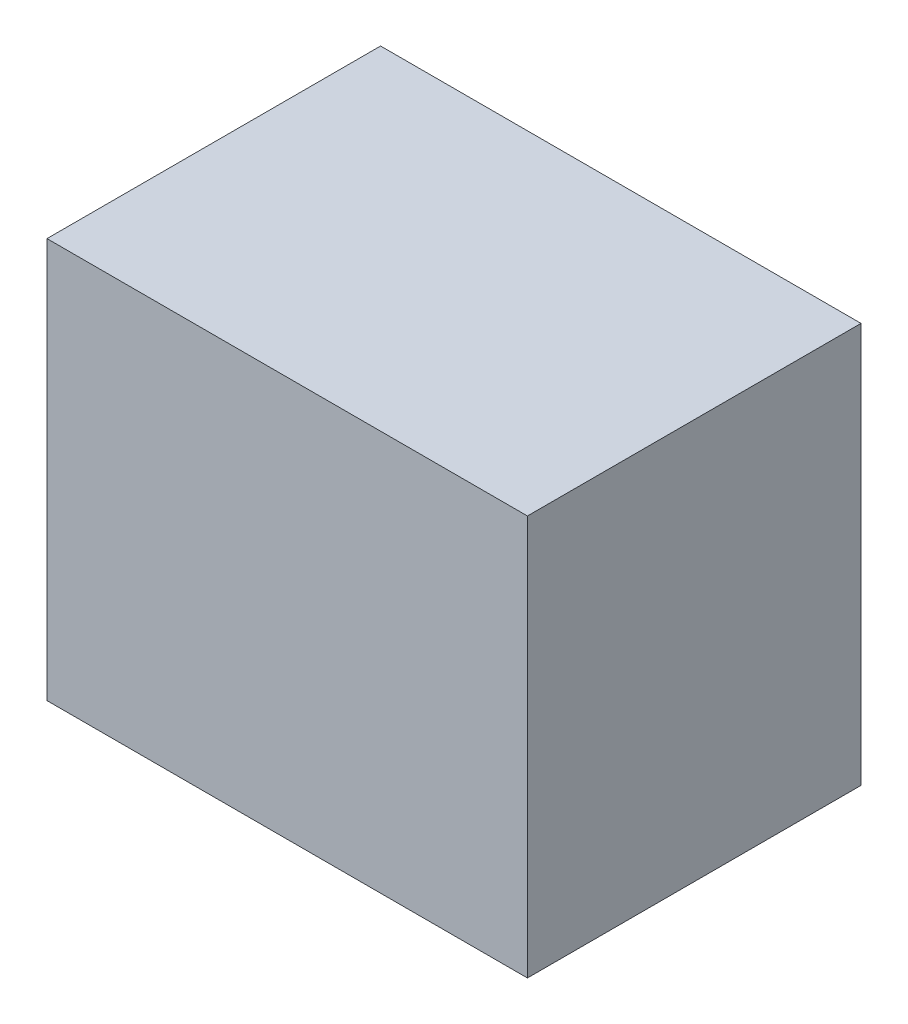
ISO-10303-21;
HEADER;
FILE_DESCRIPTION(('STEP AP214'),'2;1');
FILE_NAME('part.step','',(''),(''),'','','');
FILE_SCHEMA(('AUTOMOTIVE_DESIGN { 1 0 10303 214 1 1 1 1 }'));
ENDSEC;
DATA;
#1=APPLICATION_CONTEXT('core data for automotive mechanical design processes');
#2=APPLICATION_PROTOCOL_DEFINITION('international standard','automotive_design',2000,#1);
#3=PRODUCT_CONTEXT('',#1,'mechanical');
#4=PRODUCT('Part','Part','',(#3));
#5=PRODUCT_RELATED_PRODUCT_CATEGORY('part','',(#4));
#6=PRODUCT_DEFINITION_FORMATION('','',#4);
#7=PRODUCT_DEFINITION_CONTEXT('part definition',#1,'design');
#8=PRODUCT_DEFINITION('design','',#6,#7);
#9=PRODUCT_DEFINITION_SHAPE('','',#8);
#10=(LENGTH_UNIT() NAMED_UNIT(*) SI_UNIT(.MILLI.,.METRE.));
#11=(NAMED_UNIT(*) PLANE_ANGLE_UNIT() SI_UNIT($,.RADIAN.));
#12=(NAMED_UNIT(*) SI_UNIT($,.STERADIAN.) SOLID_ANGLE_UNIT());
#13=UNCERTAINTY_MEASURE_WITH_UNIT(LENGTH_MEASURE(1.E-05),#10,'distance_accuracy_value','');
#14=(GEOMETRIC_REPRESENTATION_CONTEXT(3) GLOBAL_UNCERTAINTY_ASSIGNED_CONTEXT((#13)) GLOBAL_UNIT_ASSIGNED_CONTEXT((#10,
#11,#12)) REPRESENTATION_CONTEXT('',''));
#15=CARTESIAN_POINT('',(0.,0.,0.));
#16=DIRECTION('',(0.,0.,1.));
#17=DIRECTION('',(1.,0.,0.));
#18=AXIS2_PLACEMENT_3D('',#15,#16,#17);
#19=CARTESIAN_POINT('',(8.73499904,-7.27499942,12.1299986));
#20=DIRECTION('',(0.,0.,1.));
#21=DIRECTION('',(1.,0.,0.));
#22=AXIS2_PLACEMENT_3D('',#19,#20,#21);
#23=PLANE('',#22);
#24=DIRECTION('',(0.,1.,0.));
#25=VECTOR('',#24,1.);
#26=CARTESIAN_POINT('',(-8.73499904,-7.27499942,12.1299986));
#27=LINE('',#26,#25);
#28=CARTESIAN_POINT('',(-8.73499904,-7.27499942,12.1299986));
#29=VERTEX_POINT('',#28);
#30=CARTESIAN_POINT('',(-8.73499904,7.27500196,12.1299986));
#31=VERTEX_POINT('',#30);
#32=EDGE_CURVE('E53',#29,#31,#27,.T.);
#33=ORIENTED_EDGE('',*,*,#32,.F.);
#34=DIRECTION('',(1.,0.,0.));
#35=VECTOR('',#34,1.);
#36=CARTESIAN_POINT('',(8.73499904,-7.27499942,12.1299986));
#37=LINE('',#36,#35);
#38=CARTESIAN_POINT('',(8.73499904,-7.27499942,12.1299986));
#39=VERTEX_POINT('',#38);
#40=EDGE_CURVE('E68',#39,#29,#37,.F.);
#41=ORIENTED_EDGE('',*,*,#40,.F.);
#42=DIRECTION('',(0.,1.,0.));
#43=VECTOR('',#42,1.);
#44=CARTESIAN_POINT('',(8.73499904,7.27500196,12.1299986));
#45=LINE('',#44,#43);
#46=CARTESIAN_POINT('',(8.73499904,7.27500196,12.1299986));
#47=VERTEX_POINT('',#46);
#48=EDGE_CURVE('E20',#47,#39,#45,.F.);
#49=ORIENTED_EDGE('',*,*,#48,.F.);
#50=DIRECTION('',(1.,0.,0.));
#51=VECTOR('',#50,1.);
#52=CARTESIAN_POINT('',(-8.73499904,7.27500196,12.1299986));
#53=LINE('',#52,#51);
#54=EDGE_CURVE('E58',#31,#47,#53,.T.);
#55=ORIENTED_EDGE('',*,*,#54,.F.);
#56=EDGE_LOOP('',(#33,#41,#49,#55));
#57=FACE_BOUND('',#56,.T.);
#58=ADVANCED_FACE('F17',(#57),#23,.T.);
#59=CARTESIAN_POINT('',(8.73499904,7.27500196,0.));
#60=DIRECTION('',(1.,0.,0.));
#61=DIRECTION('',(0.,0.,-1.));
#62=AXIS2_PLACEMENT_3D('',#59,#60,#61);
#63=PLANE('',#62);
#64=DIRECTION('',(0.,0.,-1.));
#65=VECTOR('',#64,1.);
#66=CARTESIAN_POINT('',(8.73499904,-7.27499942,0.));
#67=LINE('',#66,#65);
#68=CARTESIAN_POINT('',(8.73499904,-7.27499942,0.));
#69=VERTEX_POINT('',#68);
#70=EDGE_CURVE('E79',#69,#39,#67,.F.);
#71=ORIENTED_EDGE('',*,*,#70,.F.);
#72=DIRECTION('',(0.,1.,0.));
#73=VECTOR('',#72,1.);
#74=CARTESIAN_POINT('',(8.73499904,-7.27499942,0.));
#75=LINE('',#74,#73);
#76=CARTESIAN_POINT('',(8.73499904,7.27500196,0.));
#77=VERTEX_POINT('',#76);
#78=EDGE_CURVE('E74',#69,#77,#75,.T.);
#79=ORIENTED_EDGE('',*,*,#78,.T.);
#80=DIRECTION('',(0.,0.,1.));
#81=VECTOR('',#80,1.);
#82=CARTESIAN_POINT('',(8.73499904,7.27500196,0.));
#83=LINE('',#82,#81);
#84=EDGE_CURVE('E63',#47,#77,#83,.F.);
#85=ORIENTED_EDGE('',*,*,#84,.F.);
#86=ORIENTED_EDGE('',*,*,#48,.T.);
#87=EDGE_LOOP('',(#71,#79,#85,#86));
#88=FACE_BOUND('',#87,.T.);
#89=ADVANCED_FACE('F73',(#88),#63,.T.);
#90=CARTESIAN_POINT('',(-8.73499904,7.27500196,0.));
#91=DIRECTION('',(0.,1.,0.));
#92=DIRECTION('',(0.,0.,1.));
#93=AXIS2_PLACEMENT_3D('',#90,#91,#92);
#94=PLANE('',#93);
#95=ORIENTED_EDGE('',*,*,#84,.T.);
#96=DIRECTION('',(1.,0.,0.));
#97=VECTOR('',#96,1.);
#98=CARTESIAN_POINT('',(8.73499904,7.27500196,0.));
#99=LINE('',#98,#97);
#100=CARTESIAN_POINT('',(-8.73499904,7.27500196,0.));
#101=VERTEX_POINT('',#100);
#102=EDGE_CURVE('E84',#77,#101,#99,.F.);
#103=ORIENTED_EDGE('',*,*,#102,.T.);
#104=DIRECTION('',(0.,0.,1.));
#105=VECTOR('',#104,1.);
#106=CARTESIAN_POINT('',(-8.73499904,7.27500196,0.));
#107=LINE('',#106,#105);
#108=EDGE_CURVE('E65',#31,#101,#107,.F.);
#109=ORIENTED_EDGE('',*,*,#108,.F.);
#110=ORIENTED_EDGE('',*,*,#54,.T.);
#111=EDGE_LOOP('',(#95,#103,#109,#110));
#112=FACE_BOUND('',#111,.T.);
#113=ADVANCED_FACE('F60',(#112),#94,.T.);
#114=CARTESIAN_POINT('',(-8.73499904,-7.27499942,0.));
#115=DIRECTION('',(-1.,0.,0.));
#116=DIRECTION('',(0.,0.,1.));
#117=AXIS2_PLACEMENT_3D('',#114,#115,#116);
#118=PLANE('',#117);
#119=ORIENTED_EDGE('',*,*,#108,.T.);
#120=DIRECTION('',(0.,1.,0.));
#121=VECTOR('',#120,1.);
#122=CARTESIAN_POINT('',(-8.73499904,-7.27499942,0.));
#123=LINE('',#122,#121);
#124=CARTESIAN_POINT('',(-8.73499904,-7.27499942,0.));
#125=VERTEX_POINT('',#124);
#126=EDGE_CURVE('E26',#101,#125,#123,.F.);
#127=ORIENTED_EDGE('',*,*,#126,.T.);
#128=DIRECTION('',(0.,0.,-1.));
#129=VECTOR('',#128,1.);
#130=CARTESIAN_POINT('',(-8.73499904,-7.27499942,0.));
#131=LINE('',#130,#129);
#132=EDGE_CURVE('E34',#29,#125,#131,.T.);
#133=ORIENTED_EDGE('',*,*,#132,.F.);
#134=ORIENTED_EDGE('',*,*,#32,.T.);
#135=EDGE_LOOP('',(#119,#127,#133,#134));
#136=FACE_BOUND('',#135,.T.);
#137=ADVANCED_FACE('F88',(#136),#118,.T.);
#138=CARTESIAN_POINT('',(8.73499904,-7.27499942,0.));
#139=DIRECTION('',(0.,-1.,0.));
#140=DIRECTION('',(0.,0.,-1.));
#141=AXIS2_PLACEMENT_3D('',#138,#139,#140);
#142=PLANE('',#141);
#143=ORIENTED_EDGE('',*,*,#132,.T.);
#144=DIRECTION('',(1.,0.,0.));
#145=VECTOR('',#144,1.);
#146=CARTESIAN_POINT('',(8.73499904,-7.27499942,0.));
#147=LINE('',#146,#145);
#148=EDGE_CURVE('E11',#125,#69,#147,.T.);
#149=ORIENTED_EDGE('',*,*,#148,.T.);
#150=ORIENTED_EDGE('',*,*,#70,.T.);
#151=ORIENTED_EDGE('',*,*,#40,.T.);
#152=EDGE_LOOP('',(#143,#149,#150,#151));
#153=FACE_BOUND('',#152,.T.);
#154=ADVANCED_FACE('F91',(#153),#142,.T.);
#155=CARTESIAN_POINT('',(8.73499904,-7.27499942,0.));
#156=DIRECTION('',(0.,0.,1.));
#157=DIRECTION('',(1.,0.,0.));
#158=AXIS2_PLACEMENT_3D('',#155,#156,#157);
#159=PLANE('',#158);
#160=ORIENTED_EDGE('',*,*,#126,.F.);
#161=ORIENTED_EDGE('',*,*,#102,.F.);
#162=ORIENTED_EDGE('',*,*,#78,.F.);
#163=ORIENTED_EDGE('',*,*,#148,.F.);
#164=EDGE_LOOP('',(#160,#161,#162,#163));
#165=FACE_BOUND('',#164,.T.);
#166=ADVANCED_FACE('F90',(#165),#159,.F.);
#167=CLOSED_SHELL('',(#58,#89,#113,#137,#154,#166));
#168=MANIFOLD_SOLID_BREP('B1',#167);
#169=ADVANCED_BREP_SHAPE_REPRESENTATION('',(#18,#168),#14);
#170=SHAPE_DEFINITION_REPRESENTATION(#9,#169);
ENDSEC;
END-ISO-10303-21;
